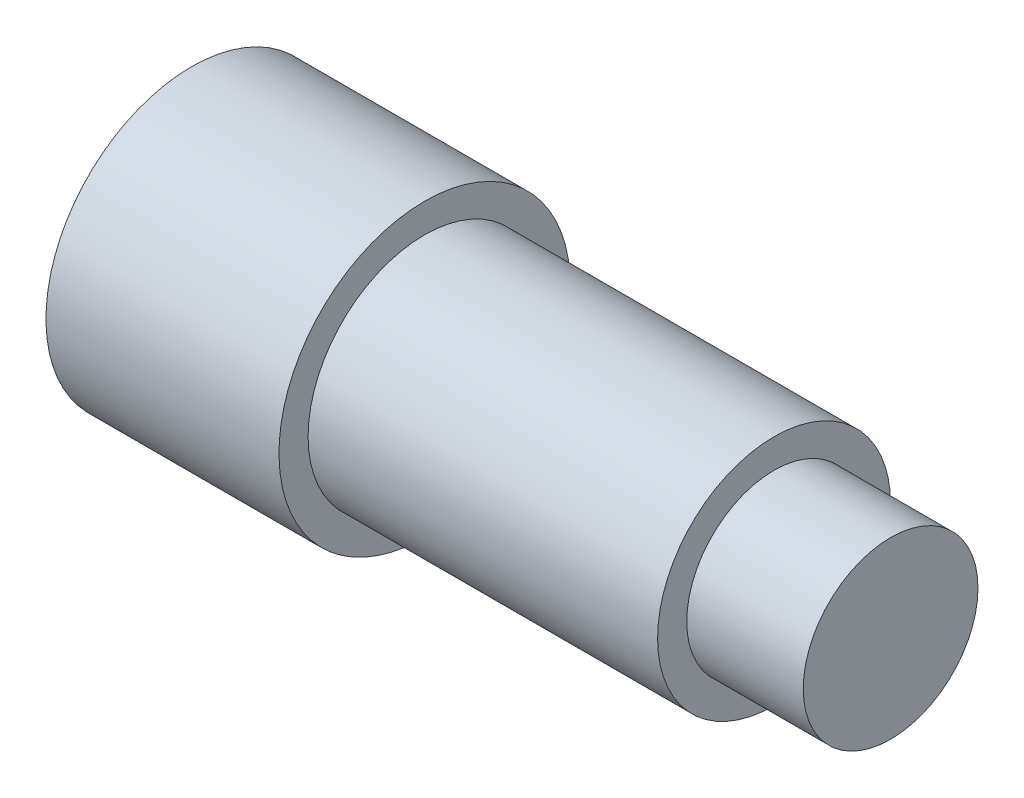
ISO-10303-21;
HEADER;
FILE_DESCRIPTION(('STEP AP214'),'2;1');
FILE_NAME('part.step','',(''),(''),'','','');
FILE_SCHEMA(('AUTOMOTIVE_DESIGN { 1 0 10303 214 1 1 1 1 }'));
ENDSEC;
DATA;
#1=APPLICATION_CONTEXT('core data for automotive mechanical design processes');
#2=APPLICATION_PROTOCOL_DEFINITION('international standard','automotive_design',2000,#1);
#3=PRODUCT_CONTEXT('',#1,'mechanical');
#4=PRODUCT('Part','Part','',(#3));
#5=PRODUCT_RELATED_PRODUCT_CATEGORY('part','',(#4));
#6=PRODUCT_DEFINITION_FORMATION('','',#4);
#7=PRODUCT_DEFINITION_CONTEXT('part definition',#1,'design');
#8=PRODUCT_DEFINITION('design','',#6,#7);
#9=PRODUCT_DEFINITION_SHAPE('','',#8);
#10=(LENGTH_UNIT() NAMED_UNIT(*) SI_UNIT(.MILLI.,.METRE.));
#11=(NAMED_UNIT(*) PLANE_ANGLE_UNIT() SI_UNIT($,.RADIAN.));
#12=(NAMED_UNIT(*) SI_UNIT($,.STERADIAN.) SOLID_ANGLE_UNIT());
#13=UNCERTAINTY_MEASURE_WITH_UNIT(LENGTH_MEASURE(1.E-05),#10,'distance_accuracy_value','');
#14=(GEOMETRIC_REPRESENTATION_CONTEXT(3) GLOBAL_UNCERTAINTY_ASSIGNED_CONTEXT((#13)) GLOBAL_UNIT_ASSIGNED_CONTEXT((#10,
#11,#12)) REPRESENTATION_CONTEXT('',''));
#15=CARTESIAN_POINT('',(0.,0.,0.));
#16=DIRECTION('',(0.,0.,1.));
#17=DIRECTION('',(1.,0.,0.));
#18=AXIS2_PLACEMENT_3D('',#15,#16,#17);
#19=CARTESIAN_POINT('',(0.,0.,0.));
#20=DIRECTION('',(-1.,0.,0.));
#21=DIRECTION('',(0.,-1.,0.));
#22=AXIS2_PLACEMENT_3D('',#19,#20,#21);
#23=PLANE('',#22);
#24=CARTESIAN_POINT('',(0.,0.,0.));
#25=DIRECTION('',(1.,0.,0.));
#26=DIRECTION('',(0.,1.,0.));
#27=AXIS2_PLACEMENT_3D('',#24,#25,#26);
#28=CIRCLE('',#27,2.5);
#29=CARTESIAN_POINT('',(0.,2.5,0.));
#30=VERTEX_POINT('',#29);
#31=EDGE_CURVE('E10',#30,#30,#28,.T.);
#32=ORIENTED_EDGE('',*,*,#31,.F.);
#33=EDGE_LOOP('',(#32));
#34=FACE_BOUND('',#33,.T.);
#35=ADVANCED_FACE('F35',(#34),#23,.T.);
#36=CARTESIAN_POINT('',(12.,0.,0.));
#37=DIRECTION('',(1.,0.,0.));
#38=DIRECTION('',(0.,1.,0.));
#39=AXIS2_PLACEMENT_3D('',#36,#37,#38);
#40=CYLINDRICAL_SURFACE('',#39,2.5);
#41=ORIENTED_EDGE('',*,*,#31,.T.);
#42=EDGE_LOOP('',(#41));
#43=FACE_BOUND('',#42,.T.);
#44=CARTESIAN_POINT('',(4.,0.,0.));
#45=DIRECTION('',(1.,0.,0.));
#46=DIRECTION('',(0.,1.,0.));
#47=AXIS2_PLACEMENT_3D('',#44,#45,#46);
#48=CIRCLE('',#47,2.5);
#49=CARTESIAN_POINT('',(4.,2.5,0.));
#50=VERTEX_POINT('',#49);
#51=EDGE_CURVE('E41',#50,#50,#48,.T.);
#52=ORIENTED_EDGE('',*,*,#51,.F.);
#53=EDGE_LOOP('',(#52));
#54=FACE_BOUND('',#53,.T.);
#55=ADVANCED_FACE('F77',(#43,#54),#40,.T.);
#56=CARTESIAN_POINT('',(4.,2.5,0.));
#57=DIRECTION('',(1.,0.,0.));
#58=DIRECTION('',(0.,1.,0.));
#59=AXIS2_PLACEMENT_3D('',#56,#57,#58);
#60=PLANE('',#59);
#61=ORIENTED_EDGE('',*,*,#51,.T.);
#62=EDGE_LOOP('',(#61));
#63=FACE_BOUND('',#62,.T.);
#64=CARTESIAN_POINT('',(4.,0.,0.));
#65=DIRECTION('',(1.,0.,0.));
#66=DIRECTION('',(0.,1.,0.));
#67=AXIS2_PLACEMENT_3D('',#64,#65,#66);
#68=CIRCLE('',#67,2.);
#69=CARTESIAN_POINT('',(4.,2.,0.));
#70=VERTEX_POINT('',#69);
#71=EDGE_CURVE('E45',#70,#70,#68,.T.);
#72=ORIENTED_EDGE('',*,*,#71,.F.);
#73=EDGE_LOOP('',(#72));
#74=FACE_BOUND('',#73,.T.);
#75=ADVANCED_FACE('F82',(#63,#74),#60,.T.);
#76=CARTESIAN_POINT('',(12.,0.,0.));
#77=DIRECTION('',(1.,0.,0.));
#78=DIRECTION('',(0.,1.,0.));
#79=AXIS2_PLACEMENT_3D('',#76,#77,#78);
#80=CYLINDRICAL_SURFACE('',#79,2.00000000000001);
#81=ORIENTED_EDGE('',*,*,#71,.T.);
#82=EDGE_LOOP('',(#81));
#83=FACE_BOUND('',#82,.T.);
#84=CARTESIAN_POINT('',(10.,0.,0.));
#85=DIRECTION('',(1.,0.,0.));
#86=DIRECTION('',(0.,1.,0.));
#87=AXIS2_PLACEMENT_3D('',#84,#85,#86);
#88=CIRCLE('',#87,2.00000000000001);
#89=CARTESIAN_POINT('',(10.,2.,0.));
#90=VERTEX_POINT('',#89);
#91=EDGE_CURVE('E49',#90,#90,#88,.T.);
#92=ORIENTED_EDGE('',*,*,#91,.F.);
#93=EDGE_LOOP('',(#92));
#94=FACE_BOUND('',#93,.T.);
#95=ADVANCED_FACE('F73',(#83,#94),#80,.T.);
#96=CARTESIAN_POINT('',(10.,2.,0.));
#97=DIRECTION('',(1.,0.,0.));
#98=DIRECTION('',(0.,1.,0.));
#99=AXIS2_PLACEMENT_3D('',#96,#97,#98);
#100=PLANE('',#99);
#101=ORIENTED_EDGE('',*,*,#91,.T.);
#102=EDGE_LOOP('',(#101));
#103=FACE_BOUND('',#102,.T.);
#104=CARTESIAN_POINT('',(10.,0.,0.));
#105=DIRECTION('',(1.,0.,0.));
#106=DIRECTION('',(0.,1.,0.));
#107=AXIS2_PLACEMENT_3D('',#104,#105,#106);
#108=CIRCLE('',#107,1.50000000000001);
#109=CARTESIAN_POINT('',(10.,1.5,0.));
#110=VERTEX_POINT('',#109);
#111=EDGE_CURVE('E54',#110,#110,#108,.T.);
#112=ORIENTED_EDGE('',*,*,#111,.F.);
#113=EDGE_LOOP('',(#112));
#114=FACE_BOUND('',#113,.T.);
#115=ADVANCED_FACE('F65',(#103,#114),#100,.T.);
#116=CARTESIAN_POINT('',(12.,0.,0.));
#117=DIRECTION('',(1.,0.,0.));
#118=DIRECTION('',(0.,1.,0.));
#119=AXIS2_PLACEMENT_3D('',#116,#117,#118);
#120=CYLINDRICAL_SURFACE('',#119,1.50000000000001);
#121=ORIENTED_EDGE('',*,*,#111,.T.);
#122=EDGE_LOOP('',(#121));
#123=FACE_BOUND('',#122,.T.);
#124=CARTESIAN_POINT('',(12.,0.,0.));
#125=DIRECTION('',(1.,0.,0.));
#126=DIRECTION('',(0.,1.,0.));
#127=AXIS2_PLACEMENT_3D('',#124,#125,#126);
#128=CIRCLE('',#127,1.5);
#129=CARTESIAN_POINT('',(12.,1.49999999999999,0.));
#130=VERTEX_POINT('',#129);
#131=EDGE_CURVE('E57',#130,#130,#128,.T.);
#132=ORIENTED_EDGE('',*,*,#131,.F.);
#133=EDGE_LOOP('',(#132));
#134=FACE_BOUND('',#133,.T.);
#135=ADVANCED_FACE('F63',(#123,#134),#120,.T.);
#136=CARTESIAN_POINT('',(12.,1.49999999999999,0.));
#137=DIRECTION('',(1.,0.,0.));
#138=DIRECTION('',(0.,1.,0.));
#139=AXIS2_PLACEMENT_3D('',#136,#137,#138);
#140=PLANE('',#139);
#141=ORIENTED_EDGE('',*,*,#131,.T.);
#142=EDGE_LOOP('',(#141));
#143=FACE_BOUND('',#142,.T.);
#144=ADVANCED_FACE('F61',(#143),#140,.T.);
#145=CLOSED_SHELL('',(#35,#55,#75,#95,#115,#135,#144));
#146=MANIFOLD_SOLID_BREP('B2',#145);
#147=ADVANCED_BREP_SHAPE_REPRESENTATION('',(#18,#146),#14);
#148=SHAPE_DEFINITION_REPRESENTATION(#9,#147);
ENDSEC;
END-ISO-10303-21;
